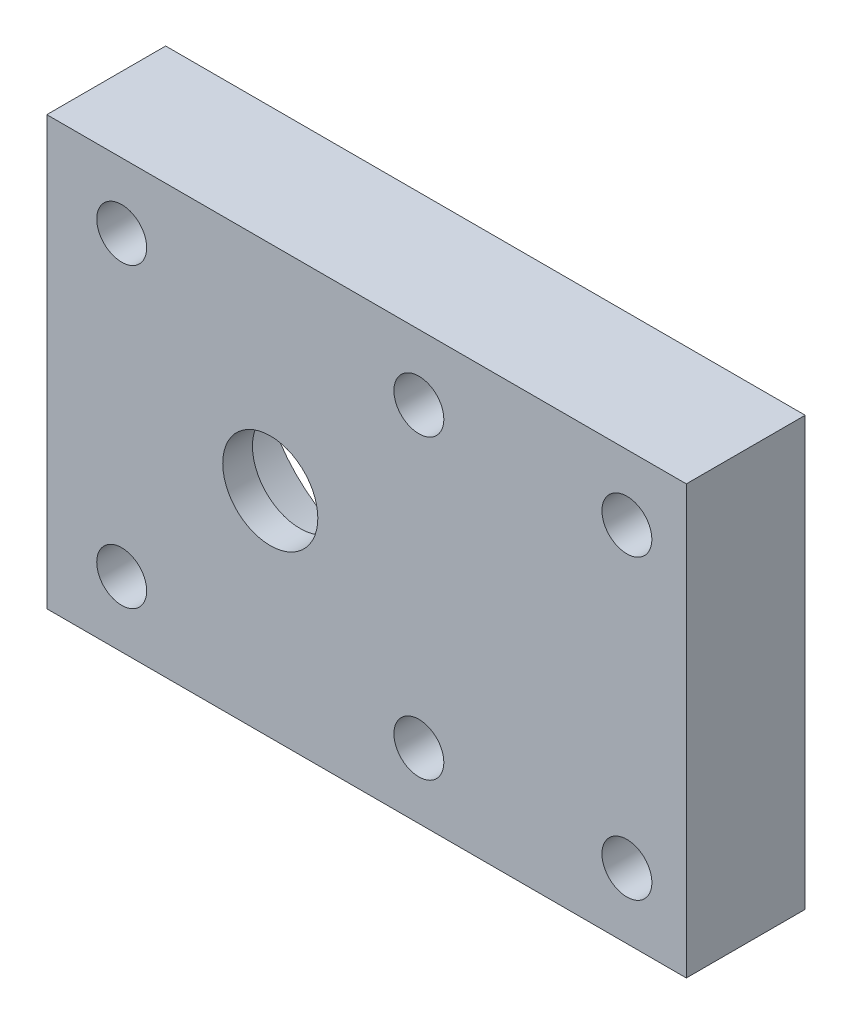
ISO-10303-21;
HEADER;
FILE_DESCRIPTION(('STEP AP214'),'2;1');
FILE_NAME('part.step','',(''),(''),'','','');
FILE_SCHEMA(('AUTOMOTIVE_DESIGN { 1 0 10303 214 1 1 1 1 }'));
ENDSEC;
DATA;
#1=APPLICATION_CONTEXT('core data for automotive mechanical design processes');
#2=APPLICATION_PROTOCOL_DEFINITION('international standard','automotive_design',2000,#1);
#3=PRODUCT_CONTEXT('',#1,'mechanical');
#4=PRODUCT('Part','Part','',(#3));
#5=PRODUCT_RELATED_PRODUCT_CATEGORY('part','',(#4));
#6=PRODUCT_DEFINITION_FORMATION('','',#4);
#7=PRODUCT_DEFINITION_CONTEXT('part definition',#1,'design');
#8=PRODUCT_DEFINITION('design','',#6,#7);
#9=PRODUCT_DEFINITION_SHAPE('','',#8);
#10=(LENGTH_UNIT() NAMED_UNIT(*) SI_UNIT(.MILLI.,.METRE.));
#11=(NAMED_UNIT(*) PLANE_ANGLE_UNIT() SI_UNIT($,.RADIAN.));
#12=(NAMED_UNIT(*) SI_UNIT($,.STERADIAN.) SOLID_ANGLE_UNIT());
#13=UNCERTAINTY_MEASURE_WITH_UNIT(LENGTH_MEASURE(1.E-05),#10,'distance_accuracy_value','');
#14=(GEOMETRIC_REPRESENTATION_CONTEXT(3) GLOBAL_UNCERTAINTY_ASSIGNED_CONTEXT((#13)) GLOBAL_UNIT_ASSIGNED_CONTEXT((#10,
#11,#12)) REPRESENTATION_CONTEXT('',''));
#15=CARTESIAN_POINT('',(0.,0.,0.));
#16=DIRECTION('',(0.,0.,1.));
#17=DIRECTION('',(1.,0.,0.));
#18=AXIS2_PLACEMENT_3D('',#15,#16,#17);
#19=CARTESIAN_POINT('',(0.,0.,10.));
#20=DIRECTION('',(0.,0.,1.));
#21=DIRECTION('',(1.,0.,0.));
#22=AXIS2_PLACEMENT_3D('',#19,#20,#21);
#23=PLANE('',#22);
#24=CARTESIAN_POINT('',(-5.,7.49999999999999,10.));
#25=DIRECTION('',(0.,0.,1.));
#26=DIRECTION('',(-1.,0.,0.));
#27=AXIS2_PLACEMENT_3D('',#24,#25,#26);
#28=CIRCLE('',#27,2.1);
#29=CARTESIAN_POINT('',(-7.09999999999999,7.49999999999999,10.));
#30=VERTEX_POINT('',#29);
#31=EDGE_CURVE('E130',#30,#30,#28,.T.);
#32=ORIENTED_EDGE('',*,*,#31,.F.);
#33=EDGE_LOOP('',(#32));
#34=FACE_BOUND('',#33,.T.);
#35=CARTESIAN_POINT('',(-22.5,7.5,10.));
#36=DIRECTION('',(0.,0.,1.));
#37=DIRECTION('',(1.,0.,0.));
#38=AXIS2_PLACEMENT_3D('',#35,#36,#37);
#39=CIRCLE('',#38,2.1);
#40=CARTESIAN_POINT('',(-20.4,7.5,10.));
#41=VERTEX_POINT('',#40);
#42=EDGE_CURVE('E118',#41,#41,#39,.T.);
#43=ORIENTED_EDGE('',*,*,#42,.F.);
#44=EDGE_LOOP('',(#43));
#45=FACE_BOUND('',#44,.T.);
#46=CARTESIAN_POINT('',(-47.5,7.49999999999998,10.));
#47=DIRECTION('',(0.,0.,1.));
#48=DIRECTION('',(-1.,0.,0.));
#49=AXIS2_PLACEMENT_3D('',#46,#47,#48);
#50=CIRCLE('',#49,2.1);
#51=CARTESIAN_POINT('',(-49.6,7.49999999999998,10.));
#52=VERTEX_POINT('',#51);
#53=EDGE_CURVE('E107',#52,#52,#50,.T.);
#54=ORIENTED_EDGE('',*,*,#53,.F.);
#55=EDGE_LOOP('',(#54));
#56=FACE_BOUND('',#55,.T.);
#57=CARTESIAN_POINT('',(-22.5,32.5,10.));
#58=DIRECTION('',(0.,0.,1.));
#59=DIRECTION('',(1.,0.,0.));
#60=AXIS2_PLACEMENT_3D('',#57,#58,#59);
#61=CIRCLE('',#60,2.1);
#62=CARTESIAN_POINT('',(-20.4,32.5,10.));
#63=VERTEX_POINT('',#62);
#64=EDGE_CURVE('E99',#63,#63,#61,.T.);
#65=ORIENTED_EDGE('',*,*,#64,.F.);
#66=EDGE_LOOP('',(#65));
#67=FACE_BOUND('',#66,.T.);
#68=CARTESIAN_POINT('',(-47.5,32.5,10.));
#69=DIRECTION('',(0.,0.,1.));
#70=DIRECTION('',(1.,0.,0.));
#71=AXIS2_PLACEMENT_3D('',#68,#69,#70);
#72=CIRCLE('',#71,2.1);
#73=CARTESIAN_POINT('',(-45.4,32.5,10.));
#74=VERTEX_POINT('',#73);
#75=EDGE_CURVE('E112',#74,#74,#72,.T.);
#76=ORIENTED_EDGE('',*,*,#75,.F.);
#77=EDGE_LOOP('',(#76));
#78=FACE_BOUND('',#77,.T.);
#79=CARTESIAN_POINT('',(-5.,32.5,10.));
#80=DIRECTION('',(0.,0.,1.));
#81=DIRECTION('',(1.,0.,0.));
#82=AXIS2_PLACEMENT_3D('',#79,#80,#81);
#83=CIRCLE('',#82,2.1);
#84=CARTESIAN_POINT('',(-2.9,32.5,10.));
#85=VERTEX_POINT('',#84);
#86=EDGE_CURVE('E124',#85,#85,#83,.T.);
#87=ORIENTED_EDGE('',*,*,#86,.F.);
#88=EDGE_LOOP('',(#87));
#89=FACE_BOUND('',#88,.T.);
#90=CARTESIAN_POINT('',(-35.,20.,10.));
#91=DIRECTION('',(0.,0.,1.));
#92=DIRECTION('',(1.,0.,0.));
#93=AXIS2_PLACEMENT_3D('',#90,#91,#92);
#94=CIRCLE('',#93,4.);
#95=CARTESIAN_POINT('',(-31.,20.,10.));
#96=VERTEX_POINT('',#95);
#97=EDGE_CURVE('E136',#96,#96,#94,.T.);
#98=ORIENTED_EDGE('',*,*,#97,.F.);
#99=EDGE_LOOP('',(#98));
#100=FACE_BOUND('',#99,.T.);
#101=DIRECTION('',(0.,1.,0.));
#102=VECTOR('',#101,1.);
#103=CARTESIAN_POINT('',(0.,0.,10.));
#104=LINE('',#103,#102);
#105=CARTESIAN_POINT('',(0.,2.,10.));
#106=VERTEX_POINT('',#105);
#107=CARTESIAN_POINT('',(0.,38.,10.));
#108=VERTEX_POINT('',#107);
#109=EDGE_CURVE('E48',#106,#108,#104,.T.);
#110=ORIENTED_EDGE('',*,*,#109,.T.);
#111=DIRECTION('',(1.,0.,0.));
#112=VECTOR('',#111,1.);
#113=CARTESIAN_POINT('',(-53.8,38.,10.));
#114=LINE('',#113,#112);
#115=CARTESIAN_POINT('',(-53.8,38.,10.));
#116=VERTEX_POINT('',#115);
#117=EDGE_CURVE('E82',#116,#108,#114,.T.);
#118=ORIENTED_EDGE('',*,*,#117,.F.);
#119=DIRECTION('',(0.,-1.,0.));
#120=VECTOR('',#119,1.);
#121=CARTESIAN_POINT('',(-53.8,0.,10.));
#122=LINE('',#121,#120);
#123=CARTESIAN_POINT('',(-53.8,2.,10.));
#124=VERTEX_POINT('',#123);
#125=EDGE_CURVE('E11',#116,#124,#122,.T.);
#126=ORIENTED_EDGE('',*,*,#125,.T.);
#127=DIRECTION('',(-1.,0.,0.));
#128=VECTOR('',#127,1.);
#129=CARTESIAN_POINT('',(0.,2.,10.));
#130=LINE('',#129,#128);
#131=EDGE_CURVE('E145',#106,#124,#130,.T.);
#132=ORIENTED_EDGE('',*,*,#131,.F.);
#133=EDGE_LOOP('',(#110,#118,#126,#132));
#134=FACE_BOUND('',#133,.T.);
#135=ADVANCED_FACE('F39',(#34,#45,#56,#67,#78,#89,#100,#134),#23,.T.);
#136=CARTESIAN_POINT('',(0.,0.,0.));
#137=DIRECTION('',(0.,0.,1.));
#138=DIRECTION('',(1.,0.,0.));
#139=AXIS2_PLACEMENT_3D('',#136,#137,#138);
#140=PLANE('',#139);
#141=CARTESIAN_POINT('',(-34.9999999999993,19.9999999999776,0.));
#142=DIRECTION('',(0.,0.,-1.));
#143=DIRECTION('',(-1.,0.,0.));
#144=AXIS2_PLACEMENT_3D('',#141,#142,#143);
#145=CIRCLE('',#144,11.0000000000071);
#146=CARTESIAN_POINT('',(-46.0000000000064,19.9999999999776,0.));
#147=VERTEX_POINT('',#146);
#148=EDGE_CURVE('E141',#147,#147,#145,.T.);
#149=ORIENTED_EDGE('',*,*,#148,.F.);
#150=EDGE_LOOP('',(#149));
#151=FACE_BOUND('',#150,.T.);
#152=CARTESIAN_POINT('',(-22.5,32.5,0.));
#153=DIRECTION('',(0.,0.,1.));
#154=DIRECTION('',(1.,0.,0.));
#155=AXIS2_PLACEMENT_3D('',#152,#153,#154);
#156=CIRCLE('',#155,2.1);
#157=CARTESIAN_POINT('',(-20.4,32.5,0.));
#158=VERTEX_POINT('',#157);
#159=EDGE_CURVE('E102',#158,#158,#156,.T.);
#160=ORIENTED_EDGE('',*,*,#159,.T.);
#161=EDGE_LOOP('',(#160));
#162=FACE_BOUND('',#161,.T.);
#163=CARTESIAN_POINT('',(-47.5,7.49999999999998,0.));
#164=DIRECTION('',(0.,0.,1.));
#165=DIRECTION('',(-1.,0.,0.));
#166=AXIS2_PLACEMENT_3D('',#163,#164,#165);
#167=CIRCLE('',#166,2.1);
#168=CARTESIAN_POINT('',(-49.6,7.49999999999998,0.));
#169=VERTEX_POINT('',#168);
#170=EDGE_CURVE('E109',#169,#169,#167,.T.);
#171=ORIENTED_EDGE('',*,*,#170,.T.);
#172=EDGE_LOOP('',(#171));
#173=FACE_BOUND('',#172,.T.);
#174=CARTESIAN_POINT('',(-47.5,32.5,0.));
#175=DIRECTION('',(0.,0.,1.));
#176=DIRECTION('',(1.,0.,0.));
#177=AXIS2_PLACEMENT_3D('',#174,#175,#176);
#178=CIRCLE('',#177,2.1);
#179=CARTESIAN_POINT('',(-45.4,32.5,0.));
#180=VERTEX_POINT('',#179);
#181=EDGE_CURVE('E115',#180,#180,#178,.T.);
#182=ORIENTED_EDGE('',*,*,#181,.T.);
#183=EDGE_LOOP('',(#182));
#184=FACE_BOUND('',#183,.T.);
#185=CARTESIAN_POINT('',(-22.5,7.5,0.));
#186=DIRECTION('',(0.,0.,1.));
#187=DIRECTION('',(1.,0.,0.));
#188=AXIS2_PLACEMENT_3D('',#185,#186,#187);
#189=CIRCLE('',#188,2.1);
#190=CARTESIAN_POINT('',(-20.4,7.5,0.));
#191=VERTEX_POINT('',#190);
#192=EDGE_CURVE('E121',#191,#191,#189,.T.);
#193=ORIENTED_EDGE('',*,*,#192,.T.);
#194=EDGE_LOOP('',(#193));
#195=FACE_BOUND('',#194,.T.);
#196=CARTESIAN_POINT('',(-5.,32.5,0.));
#197=DIRECTION('',(0.,0.,1.));
#198=DIRECTION('',(1.,0.,0.));
#199=AXIS2_PLACEMENT_3D('',#196,#197,#198);
#200=CIRCLE('',#199,2.1);
#201=CARTESIAN_POINT('',(-2.9,32.5,0.));
#202=VERTEX_POINT('',#201);
#203=EDGE_CURVE('E127',#202,#202,#200,.T.);
#204=ORIENTED_EDGE('',*,*,#203,.T.);
#205=EDGE_LOOP('',(#204));
#206=FACE_BOUND('',#205,.T.);
#207=CARTESIAN_POINT('',(-5.,7.49999999999999,0.));
#208=DIRECTION('',(0.,0.,1.));
#209=DIRECTION('',(-1.,0.,0.));
#210=AXIS2_PLACEMENT_3D('',#207,#208,#209);
#211=CIRCLE('',#210,2.1);
#212=CARTESIAN_POINT('',(-7.09999999999999,7.49999999999999,0.));
#213=VERTEX_POINT('',#212);
#214=EDGE_CURVE('E133',#213,#213,#211,.T.);
#215=ORIENTED_EDGE('',*,*,#214,.T.);
#216=EDGE_LOOP('',(#215));
#217=FACE_BOUND('',#216,.T.);
#218=DIRECTION('',(-1.,0.,0.));
#219=VECTOR('',#218,1.);
#220=CARTESIAN_POINT('',(0.,38.,0.));
#221=LINE('',#220,#219);
#222=CARTESIAN_POINT('',(0.,38.,0.));
#223=VERTEX_POINT('',#222);
#224=CARTESIAN_POINT('',(-53.8,38.,0.));
#225=VERTEX_POINT('',#224);
#226=EDGE_CURVE('E56',#223,#225,#221,.T.);
#227=ORIENTED_EDGE('',*,*,#226,.F.);
#228=DIRECTION('',(0.,1.,0.));
#229=VECTOR('',#228,1.);
#230=CARTESIAN_POINT('',(0.,0.,0.));
#231=LINE('',#230,#229);
#232=CARTESIAN_POINT('',(0.,2.,0.));
#233=VERTEX_POINT('',#232);
#234=EDGE_CURVE('E93',#233,#223,#231,.T.);
#235=ORIENTED_EDGE('',*,*,#234,.F.);
#236=DIRECTION('',(1.,0.,0.));
#237=VECTOR('',#236,1.);
#238=CARTESIAN_POINT('',(-53.8,2.,0.));
#239=LINE('',#238,#237);
#240=CARTESIAN_POINT('',(-53.8,2.,0.));
#241=VERTEX_POINT('',#240);
#242=EDGE_CURVE('E150',#241,#233,#239,.T.);
#243=ORIENTED_EDGE('',*,*,#242,.F.);
#244=DIRECTION('',(0.,-1.,0.));
#245=VECTOR('',#244,1.);
#246=CARTESIAN_POINT('',(-53.8,0.,0.));
#247=LINE('',#246,#245);
#248=EDGE_CURVE('E94',#225,#241,#247,.T.);
#249=ORIENTED_EDGE('',*,*,#248,.F.);
#250=EDGE_LOOP('',(#227,#235,#243,#249));
#251=FACE_BOUND('',#250,.T.);
#252=ADVANCED_FACE('F91',(#151,#162,#173,#184,#195,#206,#217,#251),#140,.F.);
#253=CARTESIAN_POINT('',(0.,0.,10.));
#254=DIRECTION('',(-1.,0.,0.));
#255=DIRECTION('',(0.,0.,1.));
#256=AXIS2_PLACEMENT_3D('',#253,#254,#255);
#257=PLANE('',#256);
#258=DIRECTION('',(0.,0.,-1.));
#259=VECTOR('',#258,1.);
#260=CARTESIAN_POINT('',(0.,38.,10.));
#261=LINE('',#260,#259);
#262=EDGE_CURVE('E80',#108,#223,#261,.T.);
#263=ORIENTED_EDGE('',*,*,#262,.F.);
#264=ORIENTED_EDGE('',*,*,#109,.F.);
#265=DIRECTION('',(0.,0.,1.));
#266=VECTOR('',#265,1.);
#267=CARTESIAN_POINT('',(0.,2.,0.));
#268=LINE('',#267,#266);
#269=EDGE_CURVE('E98',#233,#106,#268,.T.);
#270=ORIENTED_EDGE('',*,*,#269,.F.);
#271=ORIENTED_EDGE('',*,*,#234,.T.);
#272=EDGE_LOOP('',(#263,#264,#270,#271));
#273=FACE_BOUND('',#272,.T.);
#274=ADVANCED_FACE('F41',(#273),#257,.F.);
#275=CARTESIAN_POINT('',(-53.8,0.,10.));
#276=DIRECTION('',(1.,0.,0.));
#277=DIRECTION('',(0.,0.,-1.));
#278=AXIS2_PLACEMENT_3D('',#275,#276,#277);
#279=PLANE('',#278);
#280=DIRECTION('',(0.,0.,1.));
#281=VECTOR('',#280,1.);
#282=CARTESIAN_POINT('',(-53.8,38.,0.));
#283=LINE('',#282,#281);
#284=EDGE_CURVE('E95',#225,#116,#283,.T.);
#285=ORIENTED_EDGE('',*,*,#284,.F.);
#286=ORIENTED_EDGE('',*,*,#248,.T.);
#287=DIRECTION('',(0.,0.,-1.));
#288=VECTOR('',#287,1.);
#289=CARTESIAN_POINT('',(-53.8,2.,10.));
#290=LINE('',#289,#288);
#291=EDGE_CURVE('E152',#124,#241,#290,.T.);
#292=ORIENTED_EDGE('',*,*,#291,.F.);
#293=ORIENTED_EDGE('',*,*,#125,.F.);
#294=EDGE_LOOP('',(#285,#286,#292,#293));
#295=FACE_BOUND('',#294,.T.);
#296=ADVANCED_FACE('F158',(#295),#279,.F.);
#297=CARTESIAN_POINT('',(-35.,20.,10.));
#298=DIRECTION('',(0.,0.,-1.));
#299=DIRECTION('',(-1.,0.,0.));
#300=AXIS2_PLACEMENT_3D('',#297,#298,#299);
#301=CYLINDRICAL_SURFACE('',#300,4.);
#302=ORIENTED_EDGE('',*,*,#97,.T.);
#303=EDGE_LOOP('',(#302));
#304=FACE_BOUND('',#303,.T.);
#305=CARTESIAN_POINT('',(-35.,20.,7.5));
#306=DIRECTION('',(0.,0.,-1.));
#307=DIRECTION('',(-1.,0.,0.));
#308=AXIS2_PLACEMENT_3D('',#305,#306,#307);
#309=CIRCLE('',#308,4.);
#310=CARTESIAN_POINT('',(-39.,20.,7.5));
#311=VERTEX_POINT('',#310);
#312=EDGE_CURVE('E43',#311,#311,#309,.T.);
#313=ORIENTED_EDGE('',*,*,#312,.T.);
#314=EDGE_LOOP('',(#313));
#315=FACE_BOUND('',#314,.T.);
#316=ADVANCED_FACE('F186',(#304,#315),#301,.F.);
#317=CARTESIAN_POINT('',(-22.5,32.5,10.));
#318=DIRECTION('',(0.,0.,-1.));
#319=DIRECTION('',(-1.,0.,0.));
#320=AXIS2_PLACEMENT_3D('',#317,#318,#319);
#321=CYLINDRICAL_SURFACE('',#320,2.1);
#322=ORIENTED_EDGE('',*,*,#64,.T.);
#323=EDGE_LOOP('',(#322));
#324=FACE_BOUND('',#323,.T.);
#325=ORIENTED_EDGE('',*,*,#159,.F.);
#326=EDGE_LOOP('',(#325));
#327=FACE_BOUND('',#326,.T.);
#328=ADVANCED_FACE('F183',(#324,#327),#321,.F.);
#329=CARTESIAN_POINT('',(-47.5,7.49999999999998,10.));
#330=DIRECTION('',(0.,0.,-1.));
#331=DIRECTION('',(-1.,0.,0.));
#332=AXIS2_PLACEMENT_3D('',#329,#330,#331);
#333=CYLINDRICAL_SURFACE('',#332,2.1);
#334=ORIENTED_EDGE('',*,*,#53,.T.);
#335=EDGE_LOOP('',(#334));
#336=FACE_BOUND('',#335,.T.);
#337=ORIENTED_EDGE('',*,*,#170,.F.);
#338=EDGE_LOOP('',(#337));
#339=FACE_BOUND('',#338,.T.);
#340=ADVANCED_FACE('F271',(#336,#339),#333,.F.);
#341=CARTESIAN_POINT('',(-47.5,32.5,10.));
#342=DIRECTION('',(0.,0.,-1.));
#343=DIRECTION('',(-1.,0.,0.));
#344=AXIS2_PLACEMENT_3D('',#341,#342,#343);
#345=CYLINDRICAL_SURFACE('',#344,2.1);
#346=ORIENTED_EDGE('',*,*,#75,.T.);
#347=EDGE_LOOP('',(#346));
#348=FACE_BOUND('',#347,.T.);
#349=ORIENTED_EDGE('',*,*,#181,.F.);
#350=EDGE_LOOP('',(#349));
#351=FACE_BOUND('',#350,.T.);
#352=ADVANCED_FACE('F261',(#348,#351),#345,.F.);
#353=CARTESIAN_POINT('',(-22.5,7.5,10.));
#354=DIRECTION('',(0.,0.,-1.));
#355=DIRECTION('',(-1.,0.,0.));
#356=AXIS2_PLACEMENT_3D('',#353,#354,#355);
#357=CYLINDRICAL_SURFACE('',#356,2.1);
#358=ORIENTED_EDGE('',*,*,#42,.T.);
#359=EDGE_LOOP('',(#358));
#360=FACE_BOUND('',#359,.T.);
#361=ORIENTED_EDGE('',*,*,#192,.F.);
#362=EDGE_LOOP('',(#361));
#363=FACE_BOUND('',#362,.T.);
#364=ADVANCED_FACE('F251',(#360,#363),#357,.F.);
#365=CARTESIAN_POINT('',(-5.,32.5,10.));
#366=DIRECTION('',(0.,0.,-1.));
#367=DIRECTION('',(-1.,0.,0.));
#368=AXIS2_PLACEMENT_3D('',#365,#366,#367);
#369=CYLINDRICAL_SURFACE('',#368,2.1);
#370=ORIENTED_EDGE('',*,*,#86,.T.);
#371=EDGE_LOOP('',(#370));
#372=FACE_BOUND('',#371,.T.);
#373=ORIENTED_EDGE('',*,*,#203,.F.);
#374=EDGE_LOOP('',(#373));
#375=FACE_BOUND('',#374,.T.);
#376=ADVANCED_FACE('F241',(#372,#375),#369,.F.);
#377=CARTESIAN_POINT('',(-5.,7.49999999999999,10.));
#378=DIRECTION('',(0.,0.,-1.));
#379=DIRECTION('',(-1.,0.,0.));
#380=AXIS2_PLACEMENT_3D('',#377,#378,#379);
#381=CYLINDRICAL_SURFACE('',#380,2.1);
#382=ORIENTED_EDGE('',*,*,#31,.T.);
#383=EDGE_LOOP('',(#382));
#384=FACE_BOUND('',#383,.T.);
#385=ORIENTED_EDGE('',*,*,#214,.F.);
#386=EDGE_LOOP('',(#385));
#387=FACE_BOUND('',#386,.T.);
#388=ADVANCED_FACE('F224',(#384,#387),#381,.F.);
#389=CARTESIAN_POINT('',(-34.9999999999993,19.9999999999776,7.5));
#390=DIRECTION('',(0.,0.,-1.));
#391=DIRECTION('',(-1.,0.,0.));
#392=AXIS2_PLACEMENT_3D('',#389,#390,#391);
#393=CYLINDRICAL_SURFACE('',#392,11.0000000000071);
#394=CARTESIAN_POINT('',(-34.9999999999993,19.9999999999776,7.5));
#395=DIRECTION('',(0.,0.,-1.));
#396=DIRECTION('',(-1.,0.,0.));
#397=AXIS2_PLACEMENT_3D('',#394,#395,#396);
#398=CIRCLE('',#397,11.0000000000071);
#399=CARTESIAN_POINT('',(-46.0000000000064,19.9999999999776,7.5));
#400=VERTEX_POINT('',#399);
#401=EDGE_CURVE('E144',#400,#400,#398,.T.);
#402=ORIENTED_EDGE('',*,*,#401,.F.);
#403=EDGE_LOOP('',(#402));
#404=FACE_BOUND('',#403,.T.);
#405=ORIENTED_EDGE('',*,*,#148,.T.);
#406=EDGE_LOOP('',(#405));
#407=FACE_BOUND('',#406,.T.);
#408=ADVANCED_FACE('F169',(#404,#407),#393,.F.);
#409=CARTESIAN_POINT('',(-34.9999999999993,19.9999999999776,7.5));
#410=DIRECTION('',(0.,0.,-1.));
#411=DIRECTION('',(-1.,0.,0.));
#412=AXIS2_PLACEMENT_3D('',#409,#410,#411);
#413=PLANE('',#412);
#414=ORIENTED_EDGE('',*,*,#312,.F.);
#415=EDGE_LOOP('',(#414));
#416=FACE_BOUND('',#415,.T.);
#417=ORIENTED_EDGE('',*,*,#401,.T.);
#418=EDGE_LOOP('',(#417));
#419=FACE_BOUND('',#418,.T.);
#420=ADVANCED_FACE('F162',(#416,#419),#413,.T.);
#421=CARTESIAN_POINT('',(0.,2.,0.));
#422=DIRECTION('',(0.,-1.,0.));
#423=DIRECTION('',(0.,0.,-1.));
#424=AXIS2_PLACEMENT_3D('',#421,#422,#423);
#425=PLANE('',#424);
#426=ORIENTED_EDGE('',*,*,#291,.T.);
#427=ORIENTED_EDGE('',*,*,#242,.T.);
#428=ORIENTED_EDGE('',*,*,#269,.T.);
#429=ORIENTED_EDGE('',*,*,#131,.T.);
#430=EDGE_LOOP('',(#426,#427,#428,#429));
#431=FACE_BOUND('',#430,.T.);
#432=ADVANCED_FACE('F160',(#431),#425,.T.);
#433=CARTESIAN_POINT('',(0.,38.,0.));
#434=DIRECTION('',(0.,1.,0.));
#435=DIRECTION('',(-1.,0.,0.));
#436=AXIS2_PLACEMENT_3D('',#433,#434,#435);
#437=PLANE('',#436);
#438=ORIENTED_EDGE('',*,*,#262,.T.);
#439=ORIENTED_EDGE('',*,*,#226,.T.);
#440=ORIENTED_EDGE('',*,*,#284,.T.);
#441=ORIENTED_EDGE('',*,*,#117,.T.);
#442=EDGE_LOOP('',(#438,#439,#440,#441));
#443=FACE_BOUND('',#442,.T.);
#444=ADVANCED_FACE('F81',(#443),#437,.T.);
#445=CLOSED_SHELL('',(#135,#252,#274,#296,#316,#328,#340,#352,#364,#376,#388,#408,#420,#432,#444));
#446=MANIFOLD_SOLID_BREP('B2',#445);
#447=ADVANCED_BREP_SHAPE_REPRESENTATION('',(#18,#446),#14);
#448=SHAPE_DEFINITION_REPRESENTATION(#9,#447);
ENDSEC;
END-ISO-10303-21;
